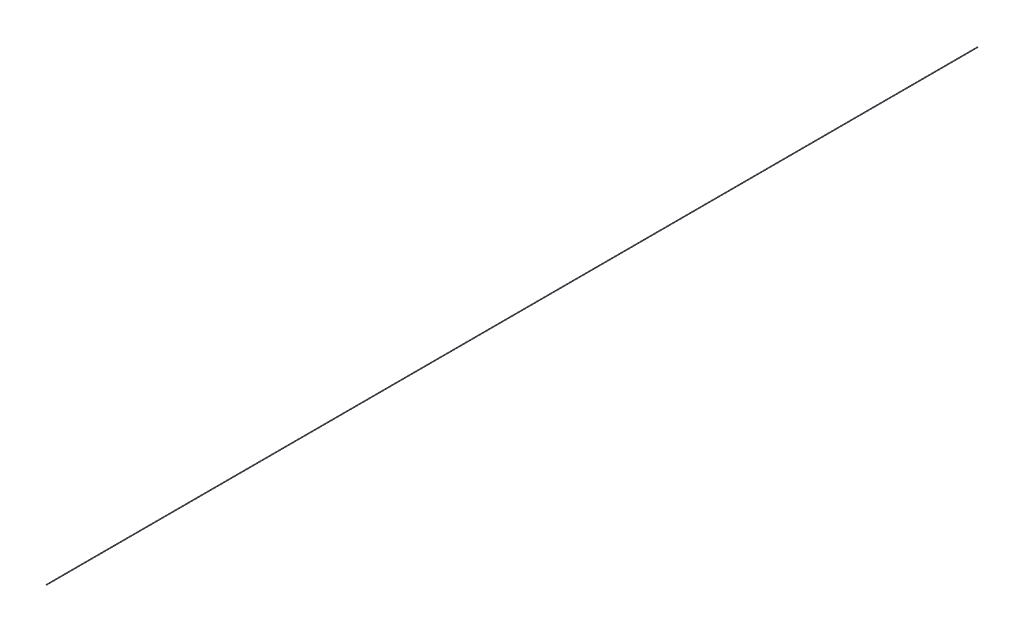
ISO-10303-21;
HEADER;
FILE_DESCRIPTION(('STEP AP214'),'2;1');
FILE_NAME('part.step','',(''),(''),'','','');
FILE_SCHEMA(('AUTOMOTIVE_DESIGN { 1 0 10303 214 1 1 1 1 }'));
ENDSEC;
DATA;
#1=APPLICATION_CONTEXT('core data for automotive mechanical design processes');
#2=APPLICATION_PROTOCOL_DEFINITION('international standard','automotive_design',2000,#1);
#3=PRODUCT_CONTEXT('',#1,'mechanical');
#4=PRODUCT('Part','Part','',(#3));
#5=PRODUCT_RELATED_PRODUCT_CATEGORY('part','',(#4));
#6=PRODUCT_DEFINITION_FORMATION('','',#4);
#7=PRODUCT_DEFINITION_CONTEXT('part definition',#1,'design');
#8=PRODUCT_DEFINITION('design','',#6,#7);
#9=PRODUCT_DEFINITION_SHAPE('','',#8);
#10=(LENGTH_UNIT() NAMED_UNIT(*) SI_UNIT(.MILLI.,.METRE.));
#11=(NAMED_UNIT(*) PLANE_ANGLE_UNIT() SI_UNIT($,.RADIAN.));
#12=(NAMED_UNIT(*) SI_UNIT($,.STERADIAN.) SOLID_ANGLE_UNIT());
#13=UNCERTAINTY_MEASURE_WITH_UNIT(LENGTH_MEASURE(1.E-05),#10,'distance_accuracy_value','');
#14=(GEOMETRIC_REPRESENTATION_CONTEXT(3) GLOBAL_UNCERTAINTY_ASSIGNED_CONTEXT((#13)) GLOBAL_UNIT_ASSIGNED_CONTEXT((#10,
#11,#12)) REPRESENTATION_CONTEXT('',''));
#15=CARTESIAN_POINT('',(0.,0.,0.));
#16=DIRECTION('',(0.,0.,1.));
#17=DIRECTION('',(1.,0.,0.));
#18=AXIS2_PLACEMENT_3D('',#15,#16,#17);
#19=CARTESIAN_POINT('',(0.,0.,800.));
#20=DIRECTION('',(0.,0.,-1.));
#21=DIRECTION('',(-1.,0.,0.));
#22=AXIS2_PLACEMENT_3D('',#19,#20,#21);
#23=CYLINDRICAL_SURFACE('',#22,0.25);
#24=CARTESIAN_POINT('',(0.,0.,800.));
#25=DIRECTION('',(0.,0.,1.));
#26=DIRECTION('',(1.,0.,0.));
#27=AXIS2_PLACEMENT_3D('',#24,#25,#26);
#28=CIRCLE('',#27,0.25);
#29=CARTESIAN_POINT('',(0.25,0.,800.));
#30=VERTEX_POINT('',#29);
#31=EDGE_CURVE('E10',#30,#30,#28,.T.);
#32=ORIENTED_EDGE('',*,*,#31,.F.);
#33=EDGE_LOOP('',(#32));
#34=FACE_BOUND('',#33,.T.);
#35=CARTESIAN_POINT('',(0.,0.,0.));
#36=DIRECTION('',(0.,0.,1.));
#37=DIRECTION('',(1.,0.,0.));
#38=AXIS2_PLACEMENT_3D('',#35,#36,#37);
#39=CIRCLE('',#38,0.25);
#40=CARTESIAN_POINT('',(0.25,0.,0.));
#41=VERTEX_POINT('',#40);
#42=EDGE_CURVE('E37',#41,#41,#39,.T.);
#43=ORIENTED_EDGE('',*,*,#42,.T.);
#44=EDGE_LOOP('',(#43));
#45=FACE_BOUND('',#44,.T.);
#46=ADVANCED_FACE('F34',(#34,#45),#23,.T.);
#47=CARTESIAN_POINT('',(0.,0.,800.));
#48=DIRECTION('',(0.,0.,1.));
#49=DIRECTION('',(1.,0.,0.));
#50=AXIS2_PLACEMENT_3D('',#47,#48,#49);
#51=PLANE('',#50);
#52=ORIENTED_EDGE('',*,*,#31,.T.);
#53=EDGE_LOOP('',(#52));
#54=FACE_BOUND('',#53,.T.);
#55=ADVANCED_FACE('F49',(#54),#51,.T.);
#56=CARTESIAN_POINT('',(0.,0.,0.));
#57=DIRECTION('',(0.,0.,1.));
#58=DIRECTION('',(1.,0.,0.));
#59=AXIS2_PLACEMENT_3D('',#56,#57,#58);
#60=PLANE('',#59);
#61=ORIENTED_EDGE('',*,*,#42,.F.);
#62=EDGE_LOOP('',(#61));
#63=FACE_BOUND('',#62,.T.);
#64=ADVANCED_FACE('F47',(#63),#60,.F.);
#65=CLOSED_SHELL('',(#46,#55,#64));
#66=MANIFOLD_SOLID_BREP('B2',#65);
#67=ADVANCED_BREP_SHAPE_REPRESENTATION('',(#18,#66),#14);
#68=SHAPE_DEFINITION_REPRESENTATION(#9,#67);
ENDSEC;
END-ISO-10303-21;
